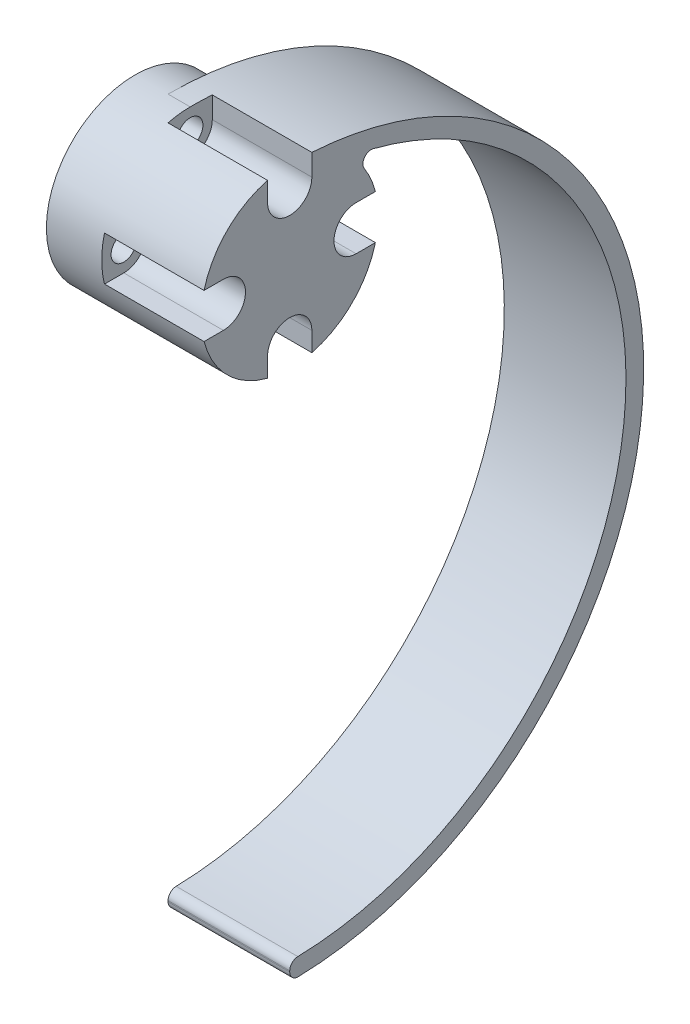
ISO-10303-21;
HEADER;
FILE_DESCRIPTION(('STEP AP214'),'2;1');
FILE_NAME('part.step','',(''),(''),'','','');
FILE_SCHEMA(('AUTOMOTIVE_DESIGN { 1 0 10303 214 1 1 1 1 }'));
ENDSEC;
DATA;
#1=APPLICATION_CONTEXT('core data for automotive mechanical design processes');
#2=APPLICATION_PROTOCOL_DEFINITION('international standard','automotive_design',2000,#1);
#3=PRODUCT_CONTEXT('',#1,'mechanical');
#4=PRODUCT('Part','Part','',(#3));
#5=PRODUCT_RELATED_PRODUCT_CATEGORY('part','',(#4));
#6=PRODUCT_DEFINITION_FORMATION('','',#4);
#7=PRODUCT_DEFINITION_CONTEXT('part definition',#1,'design');
#8=PRODUCT_DEFINITION('design','',#6,#7);
#9=PRODUCT_DEFINITION_SHAPE('','',#8);
#10=(LENGTH_UNIT() NAMED_UNIT(*) SI_UNIT(.MILLI.,.METRE.));
#11=(NAMED_UNIT(*) PLANE_ANGLE_UNIT() SI_UNIT($,.RADIAN.));
#12=(NAMED_UNIT(*) SI_UNIT($,.STERADIAN.) SOLID_ANGLE_UNIT());
#13=UNCERTAINTY_MEASURE_WITH_UNIT(LENGTH_MEASURE(1.E-05),#10,'distance_accuracy_value','');
#14=(GEOMETRIC_REPRESENTATION_CONTEXT(3) GLOBAL_UNCERTAINTY_ASSIGNED_CONTEXT((#13)) GLOBAL_UNIT_ASSIGNED_CONTEXT((#10,
#11,#12)) REPRESENTATION_CONTEXT('',''));
#15=CARTESIAN_POINT('',(0.,0.,0.));
#16=DIRECTION('',(0.,0.,1.));
#17=DIRECTION('',(1.,0.,0.));
#18=AXIS2_PLACEMENT_3D('',#15,#16,#17);
#19=CARTESIAN_POINT('',(11.,6.,0.));
#20=DIRECTION('',(-1.,0.,0.));
#21=DIRECTION('',(0.,0.,1.));
#22=AXIS2_PLACEMENT_3D('',#19,#20,#21);
#23=CYLINDRICAL_SURFACE('',#22,1.15);
#24=CARTESIAN_POINT('',(-3.,6.,0.));
#25=DIRECTION('',(1.,0.,0.));
#26=DIRECTION('',(0.,0.,-1.));
#27=AXIS2_PLACEMENT_3D('',#24,#25,#26);
#28=CIRCLE('',#27,1.15);
#29=CARTESIAN_POINT('',(-3.,6.,-1.15));
#30=VERTEX_POINT('',#29);
#31=EDGE_CURVE('E347',#30,#30,#28,.T.);
#32=ORIENTED_EDGE('',*,*,#31,.F.);
#33=EDGE_LOOP('',(#32));
#34=FACE_BOUND('',#33,.T.);
#35=CARTESIAN_POINT('',(2.,6.,0.));
#36=DIRECTION('',(1.,0.,0.));
#37=DIRECTION('',(0.,0.,-1.));
#38=AXIS2_PLACEMENT_3D('',#35,#36,#37);
#39=CIRCLE('',#38,1.15);
#40=CARTESIAN_POINT('',(2.,6.,-1.15));
#41=VERTEX_POINT('',#40);
#42=EDGE_CURVE('E287',#41,#41,#39,.T.);
#43=ORIENTED_EDGE('',*,*,#42,.T.);
#44=EDGE_LOOP('',(#43));
#45=FACE_BOUND('',#44,.T.);
#46=ADVANCED_FACE('F34',(#34,#45),#23,.F.);
#47=CARTESIAN_POINT('',(11.,0.,6.));
#48=DIRECTION('',(-1.,0.,0.));
#49=DIRECTION('',(0.,0.,1.));
#50=AXIS2_PLACEMENT_3D('',#47,#48,#49);
#51=CYLINDRICAL_SURFACE('',#50,1.15);
#52=CARTESIAN_POINT('',(-3.,0.,6.));
#53=DIRECTION('',(1.,0.,0.));
#54=DIRECTION('',(0.,0.,-1.));
#55=AXIS2_PLACEMENT_3D('',#52,#53,#54);
#56=CIRCLE('',#55,1.15);
#57=CARTESIAN_POINT('',(-3.,0.,4.85));
#58=VERTEX_POINT('',#57);
#59=EDGE_CURVE('E344',#58,#58,#56,.T.);
#60=ORIENTED_EDGE('',*,*,#59,.F.);
#61=EDGE_LOOP('',(#60));
#62=FACE_BOUND('',#61,.T.);
#63=CARTESIAN_POINT('',(2.,0.,6.));
#64=DIRECTION('',(1.,0.,0.));
#65=DIRECTION('',(0.,0.,-1.));
#66=AXIS2_PLACEMENT_3D('',#63,#64,#65);
#67=CIRCLE('',#66,1.15);
#68=CARTESIAN_POINT('',(2.,0.,4.85));
#69=VERTEX_POINT('',#68);
#70=EDGE_CURVE('E296',#69,#69,#67,.T.);
#71=ORIENTED_EDGE('',*,*,#70,.T.);
#72=EDGE_LOOP('',(#71));
#73=FACE_BOUND('',#72,.T.);
#74=ADVANCED_FACE('F461',(#62,#73),#51,.F.);
#75=CARTESIAN_POINT('',(11.,-6.,0.));
#76=DIRECTION('',(-1.,0.,0.));
#77=DIRECTION('',(0.,0.,1.));
#78=AXIS2_PLACEMENT_3D('',#75,#76,#77);
#79=CYLINDRICAL_SURFACE('',#78,1.15);
#80=CARTESIAN_POINT('',(-3.,-6.,0.));
#81=DIRECTION('',(1.,0.,0.));
#82=DIRECTION('',(0.,0.,-1.));
#83=AXIS2_PLACEMENT_3D('',#80,#81,#82);
#84=CIRCLE('',#83,1.15);
#85=CARTESIAN_POINT('',(-3.,-6.,-1.15));
#86=VERTEX_POINT('',#85);
#87=EDGE_CURVE('E341',#86,#86,#84,.T.);
#88=ORIENTED_EDGE('',*,*,#87,.F.);
#89=EDGE_LOOP('',(#88));
#90=FACE_BOUND('',#89,.T.);
#91=CARTESIAN_POINT('',(2.,-6.,0.));
#92=DIRECTION('',(1.,0.,0.));
#93=DIRECTION('',(0.,0.,-1.));
#94=AXIS2_PLACEMENT_3D('',#91,#92,#93);
#95=CIRCLE('',#94,1.15);
#96=CARTESIAN_POINT('',(2.,-6.,-1.15));
#97=VERTEX_POINT('',#96);
#98=EDGE_CURVE('E293',#97,#97,#95,.T.);
#99=ORIENTED_EDGE('',*,*,#98,.T.);
#100=EDGE_LOOP('',(#99));
#101=FACE_BOUND('',#100,.T.);
#102=ADVANCED_FACE('F467',(#90,#101),#79,.F.);
#103=CARTESIAN_POINT('',(11.,0.,-6.));
#104=DIRECTION('',(-1.,0.,0.));
#105=DIRECTION('',(0.,0.,1.));
#106=AXIS2_PLACEMENT_3D('',#103,#104,#105);
#107=CYLINDRICAL_SURFACE('',#106,1.15);
#108=CARTESIAN_POINT('',(-3.,0.,-6.));
#109=DIRECTION('',(1.,0.,0.));
#110=DIRECTION('',(0.,0.,-1.));
#111=AXIS2_PLACEMENT_3D('',#108,#109,#110);
#112=CIRCLE('',#111,1.15);
#113=CARTESIAN_POINT('',(-3.,0.,-7.15));
#114=VERTEX_POINT('',#113);
#115=EDGE_CURVE('E338',#114,#114,#112,.T.);
#116=ORIENTED_EDGE('',*,*,#115,.F.);
#117=EDGE_LOOP('',(#116));
#118=FACE_BOUND('',#117,.T.);
#119=CARTESIAN_POINT('',(2.,0.,-6.));
#120=DIRECTION('',(1.,0.,0.));
#121=DIRECTION('',(0.,0.,-1.));
#122=AXIS2_PLACEMENT_3D('',#119,#120,#121);
#123=CIRCLE('',#122,1.15);
#124=CARTESIAN_POINT('',(2.,0.,-7.15));
#125=VERTEX_POINT('',#124);
#126=EDGE_CURVE('E290',#125,#125,#123,.T.);
#127=ORIENTED_EDGE('',*,*,#126,.T.);
#128=EDGE_LOOP('',(#127));
#129=FACE_BOUND('',#128,.T.);
#130=ADVANCED_FACE('F479',(#118,#129),#107,.F.);
#131=CARTESIAN_POINT('',(11.,0.,0.));
#132=DIRECTION('',(-1.,0.,0.));
#133=DIRECTION('',(0.,0.,1.));
#134=AXIS2_PLACEMENT_3D('',#131,#132,#133);
#135=CYLINDRICAL_SURFACE('',#134,8.);
#136=CARTESIAN_POINT('',(0.,0.,0.));
#137=DIRECTION('',(1.,0.,0.));
#138=DIRECTION('',(0.,0.,-1.));
#139=AXIS2_PLACEMENT_3D('',#136,#137,#138);
#140=CIRCLE('',#139,8.00000000000009);
#141=CARTESIAN_POINT('',(0.,4.31542857142857,-6.73625090424177));
#142=VERTEX_POINT('',#141);
#143=CARTESIAN_POINT('',(0.,8.,0.));
#144=VERTEX_POINT('',#143);
#145=EDGE_CURVE('E324',#142,#144,#140,.T.);
#146=ORIENTED_EDGE('',*,*,#145,.F.);
#147=DIRECTION('',(-1.,0.,0.));
#148=VECTOR('',#147,1.);
#149=CARTESIAN_POINT('',(11.,4.31542857142857,-6.73625090424176));
#150=LINE('',#149,#148);
#151=CARTESIAN_POINT('',(11.,4.31542857142857,-6.73625090424176));
#152=VERTEX_POINT('',#151);
#153=EDGE_CURVE('E364',#142,#152,#150,.F.);
#154=ORIENTED_EDGE('',*,*,#153,.T.);
#155=CARTESIAN_POINT('',(11.,0.,0.));
#156=DIRECTION('',(1.,0.,0.));
#157=DIRECTION('',(0.,0.,-1.));
#158=AXIS2_PLACEMENT_3D('',#155,#156,#157);
#159=CIRCLE('',#158,8.);
#160=CARTESIAN_POINT('',(11.,2.,-7.74596669241483));
#161=VERTEX_POINT('',#160);
#162=EDGE_CURVE('E353',#161,#152,#159,.T.);
#163=ORIENTED_EDGE('',*,*,#162,.F.);
#164=DIRECTION('',(-1.,0.,0.));
#165=VECTOR('',#164,1.);
#166=CARTESIAN_POINT('',(11.,2.,-7.74596669241483));
#167=LINE('',#166,#165);
#168=CARTESIAN_POINT('',(2.,2.,-7.74596669241483));
#169=VERTEX_POINT('',#168);
#170=EDGE_CURVE('E314',#161,#169,#167,.T.);
#171=ORIENTED_EDGE('',*,*,#170,.T.);
#172=CARTESIAN_POINT('',(2.,0.,0.));
#173=DIRECTION('',(1.,0.,0.));
#174=DIRECTION('',(0.,0.,-1.));
#175=AXIS2_PLACEMENT_3D('',#172,#173,#174);
#176=CIRCLE('',#175,8.);
#177=CARTESIAN_POINT('',(2.,-2.,-7.74596669241483));
#178=VERTEX_POINT('',#177);
#179=EDGE_CURVE('E291',#178,#169,#176,.T.);
#180=ORIENTED_EDGE('',*,*,#179,.F.);
#181=DIRECTION('',(-1.,0.,0.));
#182=VECTOR('',#181,1.);
#183=CARTESIAN_POINT('',(11.,-2.,-7.74596669241483));
#184=LINE('',#183,#182);
#185=CARTESIAN_POINT('',(11.,-2.,-7.74596669241483));
#186=VERTEX_POINT('',#185);
#187=EDGE_CURVE('E311',#178,#186,#184,.F.);
#188=ORIENTED_EDGE('',*,*,#187,.T.);
#189=CARTESIAN_POINT('',(11.,-7.74596669241483,-2.));
#190=VERTEX_POINT('',#189);
#191=EDGE_CURVE('E356',#190,#186,#159,.T.);
#192=ORIENTED_EDGE('',*,*,#191,.F.);
#193=DIRECTION('',(-1.,0.,0.));
#194=VECTOR('',#193,1.);
#195=CARTESIAN_POINT('',(11.,-7.74596669241483,-2.));
#196=LINE('',#195,#194);
#197=CARTESIAN_POINT('',(2.,-7.74596669241483,-2.));
#198=VERTEX_POINT('',#197);
#199=EDGE_CURVE('E308',#190,#198,#196,.T.);
#200=ORIENTED_EDGE('',*,*,#199,.T.);
#201=CARTESIAN_POINT('',(2.,0.,0.));
#202=DIRECTION('',(1.,0.,0.));
#203=DIRECTION('',(0.,0.,-1.));
#204=AXIS2_PLACEMENT_3D('',#201,#202,#203);
#205=CIRCLE('',#204,8.);
#206=CARTESIAN_POINT('',(2.,-7.74596669241483,2.));
#207=VERTEX_POINT('',#206);
#208=EDGE_CURVE('E294',#207,#198,#205,.T.);
#209=ORIENTED_EDGE('',*,*,#208,.F.);
#210=DIRECTION('',(-1.,0.,0.));
#211=VECTOR('',#210,1.);
#212=CARTESIAN_POINT('',(11.,-7.74596669241483,2.));
#213=LINE('',#212,#211);
#214=CARTESIAN_POINT('',(11.,-7.74596669241483,2.));
#215=VERTEX_POINT('',#214);
#216=EDGE_CURVE('E305',#207,#215,#213,.F.);
#217=ORIENTED_EDGE('',*,*,#216,.T.);
#218=CARTESIAN_POINT('',(11.,-2.,7.74596669241483));
#219=VERTEX_POINT('',#218);
#220=EDGE_CURVE('E424',#219,#215,#159,.T.);
#221=ORIENTED_EDGE('',*,*,#220,.F.);
#222=DIRECTION('',(-1.,0.,0.));
#223=VECTOR('',#222,1.);
#224=CARTESIAN_POINT('',(11.,-2.,7.74596669241483));
#225=LINE('',#224,#223);
#226=CARTESIAN_POINT('',(2.,-2.,7.74596669241483));
#227=VERTEX_POINT('',#226);
#228=EDGE_CURVE('E302',#219,#227,#225,.T.);
#229=ORIENTED_EDGE('',*,*,#228,.T.);
#230=CARTESIAN_POINT('',(2.,0.,0.));
#231=DIRECTION('',(1.,0.,0.));
#232=DIRECTION('',(0.,0.,-1.));
#233=AXIS2_PLACEMENT_3D('',#230,#231,#232);
#234=CIRCLE('',#233,8.);
#235=CARTESIAN_POINT('',(2.,2.,7.74596669241483));
#236=VERTEX_POINT('',#235);
#237=EDGE_CURVE('E297',#236,#227,#234,.T.);
#238=ORIENTED_EDGE('',*,*,#237,.F.);
#239=DIRECTION('',(-1.,0.,0.));
#240=VECTOR('',#239,1.);
#241=CARTESIAN_POINT('',(11.,2.,7.74596669241483));
#242=LINE('',#241,#240);
#243=CARTESIAN_POINT('',(11.,2.,7.74596669241483));
#244=VERTEX_POINT('',#243);
#245=EDGE_CURVE('E299',#236,#244,#242,.F.);
#246=ORIENTED_EDGE('',*,*,#245,.T.);
#247=CARTESIAN_POINT('',(11.,7.74596669241483,2.));
#248=VERTEX_POINT('',#247);
#249=EDGE_CURVE('E357',#248,#244,#159,.T.);
#250=ORIENTED_EDGE('',*,*,#249,.F.);
#251=DIRECTION('',(-1.,0.,0.));
#252=VECTOR('',#251,1.);
#253=CARTESIAN_POINT('',(11.,7.74596669241483,2.));
#254=LINE('',#253,#252);
#255=CARTESIAN_POINT('',(2.,7.74596669241483,2.));
#256=VERTEX_POINT('',#255);
#257=EDGE_CURVE('E199',#248,#256,#254,.T.);
#258=ORIENTED_EDGE('',*,*,#257,.T.);
#259=CARTESIAN_POINT('',(2.,0.,0.));
#260=DIRECTION('',(1.,0.,0.));
#261=DIRECTION('',(0.,0.,-1.));
#262=AXIS2_PLACEMENT_3D('',#259,#260,#261);
#263=CIRCLE('',#262,8.);
#264=CARTESIAN_POINT('',(2.,8.,0.));
#265=VERTEX_POINT('',#264);
#266=EDGE_CURVE('E228',#265,#256,#263,.T.);
#267=ORIENTED_EDGE('',*,*,#266,.F.);
#268=DIRECTION('',(1.,0.,0.));
#269=VECTOR('',#268,1.);
#270=CARTESIAN_POINT('',(-71.5541752799933,8.,0.));
#271=LINE('',#270,#269);
#272=EDGE_CURVE('E322',#144,#265,#271,.T.);
#273=ORIENTED_EDGE('',*,*,#272,.F.);
#274=EDGE_LOOP('',(#146,#154,#163,#171,#180,#188,#192,#200,#209,#217,#221,#229,#238,#246,#250,
#258,#267,#273));
#275=FACE_BOUND('',#274,.T.);
#276=CARTESIAN_POINT('',(-3.,0.,0.));
#277=DIRECTION('',(1.,0.,0.));
#278=DIRECTION('',(0.,0.,-1.));
#279=AXIS2_PLACEMENT_3D('',#276,#277,#278);
#280=CIRCLE('',#279,8.);
#281=CARTESIAN_POINT('',(-3.,0.,-8.));
#282=VERTEX_POINT('',#281);
#283=EDGE_CURVE('E350',#282,#282,#280,.T.);
#284=ORIENTED_EDGE('',*,*,#283,.T.);
#285=EDGE_LOOP('',(#284));
#286=FACE_BOUND('',#285,.T.);
#287=ADVANCED_FACE('F420',(#275,#286),#135,.T.);
#288=CARTESIAN_POINT('',(11.,0.,0.));
#289=DIRECTION('',(1.,0.,0.));
#290=DIRECTION('',(0.,0.,-1.));
#291=AXIS2_PLACEMENT_3D('',#288,#289,#290);
#292=PLANE('',#291);
#293=CARTESIAN_POINT('',(11.,-24.,0.));
#294=DIRECTION('',(-1.,0.,0.));
#295=DIRECTION('',(0.,0.,1.));
#296=AXIS2_PLACEMENT_3D('',#293,#294,#295);
#297=CIRCLE('',#296,30.4);
#298=CARTESIAN_POINT('',(11.,5.44647554806071,-7.55414308823065));
#299=VERTEX_POINT('',#298);
#300=CARTESIAN_POINT('',(11.,-54.3911872192215,-0.731942215088282));
#301=VERTEX_POINT('',#300);
#302=EDGE_CURVE('E318',#299,#301,#297,.T.);
#303=ORIENTED_EDGE('',*,*,#302,.T.);
#304=CARTESIAN_POINT('',(11.,-55.1409697986431,-0.75));
#305=DIRECTION('',(1.,0.,0.));
#306=DIRECTION('',(0.,0.,-1.));
#307=AXIS2_PLACEMENT_3D('',#304,#305,#306);
#308=CIRCLE('',#307,0.75);
#309=CARTESIAN_POINT('',(11.,-55.1409697986431,0.));
#310=VERTEX_POINT('',#309);
#311=EDGE_CURVE('E380',#301,#310,#308,.T.);
#312=ORIENTED_EDGE('',*,*,#311,.T.);
#313=DIRECTION('',(0.,-1.,0.));
#314=VECTOR('',#313,1.);
#315=CARTESIAN_POINT('',(11.,-56.,0.));
#316=LINE('',#315,#314);
#317=CARTESIAN_POINT('',(11.,-55.2409987036266,0.));
#318=VERTEX_POINT('',#317);
#319=EDGE_CURVE('E329',#310,#318,#316,.T.);
#320=ORIENTED_EDGE('',*,*,#319,.T.);
#321=CARTESIAN_POINT('',(11.,-55.2409987036266,-0.75));
#322=DIRECTION('',(1.,0.,0.));
#323=DIRECTION('',(0.,0.,-1.));
#324=AXIS2_PLACEMENT_3D('',#321,#322,#323);
#325=CIRCLE('',#324,0.75);
#326=CARTESIAN_POINT('',(11.,-55.9907826725137,-0.768));
#327=VERTEX_POINT('',#326);
#328=EDGE_CURVE('E378',#318,#327,#325,.T.);
#329=ORIENTED_EDGE('',*,*,#328,.T.);
#330=CARTESIAN_POINT('',(11.,-24.,0.));
#331=DIRECTION('',(1.,0.,0.));
#332=DIRECTION('',(0.,0.,1.));
#333=AXIS2_PLACEMENT_3D('',#330,#331,#332);
#334=CIRCLE('',#333,32.);
#335=CARTESIAN_POINT('',(11.,7.93743884534263,-2.));
#336=VERTEX_POINT('',#335);
#337=EDGE_CURVE('E332',#327,#336,#334,.T.);
#338=ORIENTED_EDGE('',*,*,#337,.T.);
#339=DIRECTION('',(0.,1.,0.));
#340=VECTOR('',#339,1.);
#341=CARTESIAN_POINT('',(11.,8.,-2.));
#342=LINE('',#341,#340);
#343=CARTESIAN_POINT('',(11.,6.,-2.));
#344=VERTEX_POINT('',#343);
#345=EDGE_CURVE('E216',#344,#336,#342,.T.);
#346=ORIENTED_EDGE('',*,*,#345,.F.);
#347=CARTESIAN_POINT('',(11.,6.,0.));
#348=DIRECTION('',(1.,0.,0.));
#349=DIRECTION('',(0.,0.,1.));
#350=AXIS2_PLACEMENT_3D('',#347,#348,#349);
#351=CIRCLE('',#350,2.);
#352=CARTESIAN_POINT('',(11.,6.,2.));
#353=VERTEX_POINT('',#352);
#354=EDGE_CURVE('E204',#353,#344,#351,.T.);
#355=ORIENTED_EDGE('',*,*,#354,.F.);
#356=DIRECTION('',(0.,-1.,0.));
#357=VECTOR('',#356,1.);
#358=CARTESIAN_POINT('',(11.,6.,2.));
#359=LINE('',#358,#357);
#360=EDGE_CURVE('E193',#248,#353,#359,.T.);
#361=ORIENTED_EDGE('',*,*,#360,.F.);
#362=ORIENTED_EDGE('',*,*,#249,.T.);
#363=DIRECTION('',(0.,0.,1.));
#364=VECTOR('',#363,1.);
#365=CARTESIAN_POINT('',(11.,2.,8.));
#366=LINE('',#365,#364);
#367=CARTESIAN_POINT('',(11.,2.,6.));
#368=VERTEX_POINT('',#367);
#369=EDGE_CURVE('E280',#368,#244,#366,.T.);
#370=ORIENTED_EDGE('',*,*,#369,.F.);
#371=CARTESIAN_POINT('',(11.,0.,6.));
#372=DIRECTION('',(1.,0.,0.));
#373=DIRECTION('',(0.,0.,1.));
#374=AXIS2_PLACEMENT_3D('',#371,#372,#373);
#375=CIRCLE('',#374,2.);
#376=CARTESIAN_POINT('',(11.,-2.,6.));
#377=VERTEX_POINT('',#376);
#378=EDGE_CURVE('E277',#377,#368,#375,.T.);
#379=ORIENTED_EDGE('',*,*,#378,.F.);
#380=DIRECTION('',(0.,0.,-1.));
#381=VECTOR('',#380,1.);
#382=CARTESIAN_POINT('',(11.,-2.,6.));
#383=LINE('',#382,#381);
#384=EDGE_CURVE('E274',#219,#377,#383,.T.);
#385=ORIENTED_EDGE('',*,*,#384,.F.);
#386=ORIENTED_EDGE('',*,*,#220,.T.);
#387=DIRECTION('',(0.,-1.,0.));
#388=VECTOR('',#387,1.);
#389=CARTESIAN_POINT('',(11.,-8.,2.));
#390=LINE('',#389,#388);
#391=CARTESIAN_POINT('',(11.,-6.,2.));
#392=VERTEX_POINT('',#391);
#393=EDGE_CURVE('E262',#392,#215,#390,.T.);
#394=ORIENTED_EDGE('',*,*,#393,.F.);
#395=CARTESIAN_POINT('',(11.,-6.,0.));
#396=DIRECTION('',(1.,0.,0.));
#397=DIRECTION('',(0.,0.,1.));
#398=AXIS2_PLACEMENT_3D('',#395,#396,#397);
#399=CIRCLE('',#398,2.);
#400=CARTESIAN_POINT('',(11.,-6.,-2.));
#401=VERTEX_POINT('',#400);
#402=EDGE_CURVE('E258',#401,#392,#399,.T.);
#403=ORIENTED_EDGE('',*,*,#402,.F.);
#404=DIRECTION('',(0.,1.,0.));
#405=VECTOR('',#404,1.);
#406=CARTESIAN_POINT('',(11.,-6.,-2.));
#407=LINE('',#406,#405);
#408=EDGE_CURVE('E255',#190,#401,#407,.T.);
#409=ORIENTED_EDGE('',*,*,#408,.F.);
#410=ORIENTED_EDGE('',*,*,#191,.T.);
#411=DIRECTION('',(0.,0.,-1.));
#412=VECTOR('',#411,1.);
#413=CARTESIAN_POINT('',(11.,-2.,-8.));
#414=LINE('',#413,#412);
#415=CARTESIAN_POINT('',(11.,-2.,-6.));
#416=VERTEX_POINT('',#415);
#417=EDGE_CURVE('E243',#416,#186,#414,.T.);
#418=ORIENTED_EDGE('',*,*,#417,.F.);
#419=CARTESIAN_POINT('',(11.,0.,-6.));
#420=DIRECTION('',(1.,0.,0.));
#421=DIRECTION('',(0.,0.,1.));
#422=AXIS2_PLACEMENT_3D('',#419,#420,#421);
#423=CIRCLE('',#422,2.);
#424=CARTESIAN_POINT('',(11.,2.,-6.));
#425=VERTEX_POINT('',#424);
#426=EDGE_CURVE('E239',#425,#416,#423,.T.);
#427=ORIENTED_EDGE('',*,*,#426,.F.);
#428=DIRECTION('',(0.,0.,1.));
#429=VECTOR('',#428,1.);
#430=CARTESIAN_POINT('',(11.,2.,-6.));
#431=LINE('',#430,#429);
#432=EDGE_CURVE('E236',#161,#425,#431,.T.);
#433=ORIENTED_EDGE('',*,*,#432,.F.);
#434=ORIENTED_EDGE('',*,*,#162,.T.);
#435=CARTESIAN_POINT('',(11.,4.72,-7.36777442651443));
#436=DIRECTION('',(1.,0.,0.));
#437=DIRECTION('',(0.,0.,-1.));
#438=AXIS2_PLACEMENT_3D('',#435,#436,#437);
#439=CIRCLE('',#438,0.75);
#440=EDGE_CURVE('E42',#152,#299,#439,.F.);
#441=ORIENTED_EDGE('',*,*,#440,.T.);
#442=EDGE_LOOP('',(#303,#312,#320,#329,#338,#346,#355,#361,#362,#370,#379,#385,#386,#394,#403,
#409,#410,#418,#427,#433,#434,#441));
#443=FACE_BOUND('',#442,.T.);
#444=ADVANCED_FACE('F219',(#443),#292,.T.);
#445=CARTESIAN_POINT('',(-3.,0.,0.));
#446=DIRECTION('',(1.,0.,0.));
#447=DIRECTION('',(0.,0.,-1.));
#448=AXIS2_PLACEMENT_3D('',#445,#446,#447);
#449=PLANE('',#448);
#450=ORIENTED_EDGE('',*,*,#115,.T.);
#451=EDGE_LOOP('',(#450));
#452=FACE_BOUND('',#451,.T.);
#453=ORIENTED_EDGE('',*,*,#87,.T.);
#454=EDGE_LOOP('',(#453));
#455=FACE_BOUND('',#454,.T.);
#456=ORIENTED_EDGE('',*,*,#59,.T.);
#457=EDGE_LOOP('',(#456));
#458=FACE_BOUND('',#457,.T.);
#459=ORIENTED_EDGE('',*,*,#31,.T.);
#460=EDGE_LOOP('',(#459));
#461=FACE_BOUND('',#460,.T.);
#462=ORIENTED_EDGE('',*,*,#283,.F.);
#463=EDGE_LOOP('',(#462));
#464=FACE_BOUND('',#463,.T.);
#465=ADVANCED_FACE('F476',(#452,#455,#458,#461,#464),#449,.F.);
#466=CARTESIAN_POINT('',(-71.5541752799933,-24.,0.));
#467=DIRECTION('',(1.,0.,0.));
#468=DIRECTION('',(0.,0.,-1.));
#469=AXIS2_PLACEMENT_3D('',#466,#467,#468);
#470=CYLINDRICAL_SURFACE('',#469,32.);
#471=ORIENTED_EDGE('',*,*,#337,.F.);
#472=DIRECTION('',(1.,0.,0.));
#473=VECTOR('',#472,1.);
#474=CARTESIAN_POINT('',(-71.5541752799933,-55.9907826725137,-0.768));
#475=LINE('',#474,#473);
#476=CARTESIAN_POINT('',(0.,-55.9907826725137,-0.768));
#477=VERTEX_POINT('',#476);
#478=EDGE_CURVE('E49',#327,#477,#475,.F.);
#479=ORIENTED_EDGE('',*,*,#478,.T.);
#480=CARTESIAN_POINT('',(0.,-24.,0.));
#481=DIRECTION('',(1.,0.,0.));
#482=DIRECTION('',(0.,0.,-1.));
#483=AXIS2_PLACEMENT_3D('',#480,#481,#482);
#484=CIRCLE('',#483,32.);
#485=EDGE_CURVE('E321',#144,#477,#484,.F.);
#486=ORIENTED_EDGE('',*,*,#485,.F.);
#487=ORIENTED_EDGE('',*,*,#272,.T.);
#488=CARTESIAN_POINT('',(2.,-24.,0.));
#489=DIRECTION('',(1.,0.,0.));
#490=DIRECTION('',(0.,0.,-1.));
#491=AXIS2_PLACEMENT_3D('',#488,#489,#490);
#492=CIRCLE('',#491,32.);
#493=CARTESIAN_POINT('',(2.,7.93743884534263,-2.));
#494=VERTEX_POINT('',#493);
#495=EDGE_CURVE('E358',#265,#494,#492,.F.);
#496=ORIENTED_EDGE('',*,*,#495,.T.);
#497=DIRECTION('',(1.,0.,0.));
#498=VECTOR('',#497,1.);
#499=CARTESIAN_POINT('',(-71.5541752799933,7.93743884534263,-2.));
#500=LINE('',#499,#498);
#501=EDGE_CURVE('E361',#336,#494,#500,.F.);
#502=ORIENTED_EDGE('',*,*,#501,.F.);
#503=EDGE_LOOP('',(#471,#479,#486,#487,#496,#502));
#504=FACE_BOUND('',#503,.T.);
#505=ADVANCED_FACE('F412',(#504),#470,.T.);
#506=CARTESIAN_POINT('',(-71.5541752799933,-56.,0.));
#507=DIRECTION('',(0.,0.,1.));
#508=DIRECTION('',(1.,0.,0.));
#509=AXIS2_PLACEMENT_3D('',#506,#507,#508);
#510=PLANE('',#509);
#511=ORIENTED_EDGE('',*,*,#319,.F.);
#512=DIRECTION('',(1.,0.,0.));
#513=VECTOR('',#512,1.);
#514=CARTESIAN_POINT('',(-71.5541752799933,-55.1409697986431,0.));
#515=LINE('',#514,#513);
#516=CARTESIAN_POINT('',(0.,-55.1409697986431,0.));
#517=VERTEX_POINT('',#516);
#518=EDGE_CURVE('E57',#310,#517,#515,.F.);
#519=ORIENTED_EDGE('',*,*,#518,.T.);
#520=DIRECTION('',(0.,1.,0.));
#521=VECTOR('',#520,1.);
#522=CARTESIAN_POINT('',(0.,-56.,0.));
#523=LINE('',#522,#521);
#524=CARTESIAN_POINT('',(0.,-55.2409987036266,0.));
#525=VERTEX_POINT('',#524);
#526=EDGE_CURVE('E319',#525,#517,#523,.T.);
#527=ORIENTED_EDGE('',*,*,#526,.F.);
#528=DIRECTION('',(1.,0.,0.));
#529=VECTOR('',#528,1.);
#530=CARTESIAN_POINT('',(-71.5541752799933,-55.2409987036266,0.));
#531=LINE('',#530,#529);
#532=EDGE_CURVE('E382',#525,#318,#531,.T.);
#533=ORIENTED_EDGE('',*,*,#532,.T.);
#534=EDGE_LOOP('',(#511,#519,#527,#533));
#535=FACE_BOUND('',#534,.T.);
#536=ADVANCED_FACE('F407',(#535),#510,.T.);
#537=CARTESIAN_POINT('',(-71.5541752799933,-24.,0.));
#538=DIRECTION('',(1.,0.,0.));
#539=DIRECTION('',(0.,0.,-1.));
#540=AXIS2_PLACEMENT_3D('',#537,#538,#539);
#541=CYLINDRICAL_SURFACE('',#540,30.4);
#542=ORIENTED_EDGE('',*,*,#302,.F.);
#543=DIRECTION('',(1.,0.,0.));
#544=VECTOR('',#543,1.);
#545=CARTESIAN_POINT('',(-71.5541752799933,5.44647554806071,-7.55414308823065));
#546=LINE('',#545,#544);
#547=CARTESIAN_POINT('',(0.,5.44647554806071,-7.55414308823065));
#548=VERTEX_POINT('',#547);
#549=EDGE_CURVE('E376',#299,#548,#546,.F.);
#550=ORIENTED_EDGE('',*,*,#549,.T.);
#551=CARTESIAN_POINT('',(0.,-24.,0.));
#552=DIRECTION('',(1.,0.,0.));
#553=DIRECTION('',(0.,0.,-1.));
#554=AXIS2_PLACEMENT_3D('',#551,#552,#553);
#555=CIRCLE('',#554,30.4);
#556=CARTESIAN_POINT('',(0.,-54.3911872192215,-0.731942215088282));
#557=VERTEX_POINT('',#556);
#558=EDGE_CURVE('E327',#557,#548,#555,.T.);
#559=ORIENTED_EDGE('',*,*,#558,.F.);
#560=DIRECTION('',(1.,0.,0.));
#561=VECTOR('',#560,1.);
#562=CARTESIAN_POINT('',(-71.5541752799933,-54.3911872192215,-0.731942215088282));
#563=LINE('',#562,#561);
#564=EDGE_CURVE('E373',#557,#301,#563,.T.);
#565=ORIENTED_EDGE('',*,*,#564,.T.);
#566=EDGE_LOOP('',(#542,#550,#559,#565));
#567=FACE_BOUND('',#566,.T.);
#568=ADVANCED_FACE('F397',(#567),#541,.F.);
#569=CARTESIAN_POINT('',(0.,0.,0.));
#570=DIRECTION('',(1.,0.,0.));
#571=DIRECTION('',(0.,0.,-1.));
#572=AXIS2_PLACEMENT_3D('',#569,#570,#571);
#573=PLANE('',#572);
#574=ORIENTED_EDGE('',*,*,#526,.T.);
#575=CARTESIAN_POINT('',(0.,-55.1409697986431,-0.75));
#576=DIRECTION('',(1.,0.,0.));
#577=DIRECTION('',(0.,0.,-1.));
#578=AXIS2_PLACEMENT_3D('',#575,#576,#577);
#579=CIRCLE('',#578,0.75);
#580=EDGE_CURVE('E388',#517,#557,#579,.F.);
#581=ORIENTED_EDGE('',*,*,#580,.T.);
#582=ORIENTED_EDGE('',*,*,#558,.T.);
#583=CARTESIAN_POINT('',(0.,4.72,-7.36777442651443));
#584=DIRECTION('',(1.,0.,0.));
#585=DIRECTION('',(0.,0.,-1.));
#586=AXIS2_PLACEMENT_3D('',#583,#584,#585);
#587=CIRCLE('',#586,0.75);
#588=EDGE_CURVE('E12',#548,#142,#587,.T.);
#589=ORIENTED_EDGE('',*,*,#588,.T.);
#590=ORIENTED_EDGE('',*,*,#145,.T.);
#591=ORIENTED_EDGE('',*,*,#485,.T.);
#592=CARTESIAN_POINT('',(0.,-55.2409987036266,-0.75));
#593=DIRECTION('',(1.,0.,0.));
#594=DIRECTION('',(0.,0.,-1.));
#595=AXIS2_PLACEMENT_3D('',#592,#593,#594);
#596=CIRCLE('',#595,0.75);
#597=EDGE_CURVE('E386',#477,#525,#596,.F.);
#598=ORIENTED_EDGE('',*,*,#597,.T.);
#599=EDGE_LOOP('',(#574,#581,#582,#589,#590,#591,#598));
#600=FACE_BOUND('',#599,.T.);
#601=ADVANCED_FACE('F403',(#600),#573,.F.);
#602=CARTESIAN_POINT('',(-8.65685424949238,6.,2.));
#603=DIRECTION('',(0.,0.,1.));
#604=DIRECTION('',(1.,0.,0.));
#605=AXIS2_PLACEMENT_3D('',#602,#603,#604);
#606=PLANE('',#605);
#607=ORIENTED_EDGE('',*,*,#360,.T.);
#608=DIRECTION('',(1.,0.,0.));
#609=VECTOR('',#608,1.);
#610=CARTESIAN_POINT('',(-8.65685424949238,6.,2.));
#611=LINE('',#610,#609);
#612=CARTESIAN_POINT('',(2.,6.,2.));
#613=VERTEX_POINT('',#612);
#614=EDGE_CURVE('E197',#613,#353,#611,.T.);
#615=ORIENTED_EDGE('',*,*,#614,.F.);
#616=DIRECTION('',(0.,1.,0.));
#617=VECTOR('',#616,1.);
#618=CARTESIAN_POINT('',(2.,6.,2.));
#619=LINE('',#618,#617);
#620=EDGE_CURVE('E229',#613,#256,#619,.T.);
#621=ORIENTED_EDGE('',*,*,#620,.T.);
#622=ORIENTED_EDGE('',*,*,#257,.F.);
#623=EDGE_LOOP('',(#607,#615,#621,#622));
#624=FACE_BOUND('',#623,.T.);
#625=ADVANCED_FACE('F195',(#624),#606,.F.);
#626=CARTESIAN_POINT('',(2.,0.,0.));
#627=DIRECTION('',(1.,0.,0.));
#628=DIRECTION('',(0.,0.,-1.));
#629=AXIS2_PLACEMENT_3D('',#626,#627,#628);
#630=PLANE('',#629);
#631=ORIENTED_EDGE('',*,*,#42,.F.);
#632=EDGE_LOOP('',(#631));
#633=FACE_BOUND('',#632,.T.);
#634=ORIENTED_EDGE('',*,*,#266,.T.);
#635=ORIENTED_EDGE('',*,*,#620,.F.);
#636=CARTESIAN_POINT('',(2.,6.,0.));
#637=DIRECTION('',(1.,0.,0.));
#638=DIRECTION('',(0.,0.,-1.));
#639=AXIS2_PLACEMENT_3D('',#636,#637,#638);
#640=CIRCLE('',#639,2.);
#641=CARTESIAN_POINT('',(2.,6.,-2.));
#642=VERTEX_POINT('',#641);
#643=EDGE_CURVE('E213',#642,#613,#640,.F.);
#644=ORIENTED_EDGE('',*,*,#643,.F.);
#645=DIRECTION('',(0.,-1.,0.));
#646=VECTOR('',#645,1.);
#647=CARTESIAN_POINT('',(2.,8.,-2.));
#648=LINE('',#647,#646);
#649=EDGE_CURVE('E225',#494,#642,#648,.T.);
#650=ORIENTED_EDGE('',*,*,#649,.F.);
#651=ORIENTED_EDGE('',*,*,#495,.F.);
#652=EDGE_LOOP('',(#634,#635,#644,#650,#651));
#653=FACE_BOUND('',#652,.T.);
#654=ADVANCED_FACE('F416',(#633,#653),#630,.T.);
#655=CARTESIAN_POINT('',(-8.65685424949238,8.,-2.));
#656=DIRECTION('',(0.,0.,-1.));
#657=DIRECTION('',(0.,1.,0.));
#658=AXIS2_PLACEMENT_3D('',#655,#656,#657);
#659=PLANE('',#658);
#660=ORIENTED_EDGE('',*,*,#501,.T.);
#661=ORIENTED_EDGE('',*,*,#649,.T.);
#662=DIRECTION('',(1.,0.,0.));
#663=VECTOR('',#662,1.);
#664=CARTESIAN_POINT('',(-8.65685424949238,6.,-2.));
#665=LINE('',#664,#663);
#666=EDGE_CURVE('E215',#642,#344,#665,.T.);
#667=ORIENTED_EDGE('',*,*,#666,.T.);
#668=ORIENTED_EDGE('',*,*,#345,.T.);
#669=EDGE_LOOP('',(#660,#661,#667,#668));
#670=FACE_BOUND('',#669,.T.);
#671=ADVANCED_FACE('F414',(#670),#659,.F.);
#672=CARTESIAN_POINT('',(-8.65685424949238,6.,0.));
#673=DIRECTION('',(1.,0.,0.));
#674=DIRECTION('',(0.,0.,-1.));
#675=AXIS2_PLACEMENT_3D('',#672,#673,#674);
#676=CYLINDRICAL_SURFACE('',#675,2.);
#677=ORIENTED_EDGE('',*,*,#643,.T.);
#678=ORIENTED_EDGE('',*,*,#614,.T.);
#679=ORIENTED_EDGE('',*,*,#354,.T.);
#680=ORIENTED_EDGE('',*,*,#666,.F.);
#681=EDGE_LOOP('',(#677,#678,#679,#680));
#682=FACE_BOUND('',#681,.T.);
#683=ADVANCED_FACE('F209',(#682),#676,.F.);
#684=CARTESIAN_POINT('',(-8.65685424949238,2.,-6.));
#685=DIRECTION('',(0.,1.,0.));
#686=DIRECTION('',(0.,0.,1.));
#687=AXIS2_PLACEMENT_3D('',#684,#685,#686);
#688=PLANE('',#687);
#689=ORIENTED_EDGE('',*,*,#432,.T.);
#690=DIRECTION('',(1.,0.,0.));
#691=VECTOR('',#690,1.);
#692=CARTESIAN_POINT('',(-8.65685424949238,2.,-6.));
#693=LINE('',#692,#691);
#694=CARTESIAN_POINT('',(2.,2.,-6.));
#695=VERTEX_POINT('',#694);
#696=EDGE_CURVE('E245',#695,#425,#693,.T.);
#697=ORIENTED_EDGE('',*,*,#696,.F.);
#698=DIRECTION('',(0.,0.,-1.));
#699=VECTOR('',#698,1.);
#700=CARTESIAN_POINT('',(2.,2.,-6.));
#701=LINE('',#700,#699);
#702=EDGE_CURVE('E232',#695,#169,#701,.T.);
#703=ORIENTED_EDGE('',*,*,#702,.T.);
#704=ORIENTED_EDGE('',*,*,#170,.F.);
#705=EDGE_LOOP('',(#689,#697,#703,#704));
#706=FACE_BOUND('',#705,.T.);
#707=ADVANCED_FACE('F449',(#706),#688,.F.);
#708=CARTESIAN_POINT('',(-8.65685424949238,-2.,-8.));
#709=DIRECTION('',(0.,-1.,0.));
#710=DIRECTION('',(0.,0.,-1.));
#711=AXIS2_PLACEMENT_3D('',#708,#709,#710);
#712=PLANE('',#711);
#713=DIRECTION('',(0.,0.,1.));
#714=VECTOR('',#713,1.);
#715=CARTESIAN_POINT('',(2.,-2.,-8.));
#716=LINE('',#715,#714);
#717=CARTESIAN_POINT('',(2.,-2.,-6.));
#718=VERTEX_POINT('',#717);
#719=EDGE_CURVE('E230',#178,#718,#716,.T.);
#720=ORIENTED_EDGE('',*,*,#719,.T.);
#721=DIRECTION('',(1.,0.,0.));
#722=VECTOR('',#721,1.);
#723=CARTESIAN_POINT('',(-8.65685424949238,-2.,-6.));
#724=LINE('',#723,#722);
#725=EDGE_CURVE('E233',#718,#416,#724,.T.);
#726=ORIENTED_EDGE('',*,*,#725,.T.);
#727=ORIENTED_EDGE('',*,*,#417,.T.);
#728=ORIENTED_EDGE('',*,*,#187,.F.);
#729=EDGE_LOOP('',(#720,#726,#727,#728));
#730=FACE_BOUND('',#729,.T.);
#731=ADVANCED_FACE('F439',(#730),#712,.F.);
#732=CARTESIAN_POINT('',(2.,0.,0.));
#733=DIRECTION('',(1.,0.,0.));
#734=DIRECTION('',(0.,0.,-1.));
#735=AXIS2_PLACEMENT_3D('',#732,#733,#734);
#736=PLANE('',#735);
#737=ORIENTED_EDGE('',*,*,#126,.F.);
#738=EDGE_LOOP('',(#737));
#739=FACE_BOUND('',#738,.T.);
#740=ORIENTED_EDGE('',*,*,#179,.T.);
#741=ORIENTED_EDGE('',*,*,#702,.F.);
#742=CARTESIAN_POINT('',(2.,0.,-6.));
#743=DIRECTION('',(1.,0.,0.));
#744=DIRECTION('',(0.,0.,-1.));
#745=AXIS2_PLACEMENT_3D('',#742,#743,#744);
#746=CIRCLE('',#745,2.);
#747=EDGE_CURVE('E205',#718,#695,#746,.F.);
#748=ORIENTED_EDGE('',*,*,#747,.F.);
#749=ORIENTED_EDGE('',*,*,#719,.F.);
#750=EDGE_LOOP('',(#740,#741,#748,#749));
#751=FACE_BOUND('',#750,.T.);
#752=ADVANCED_FACE('F443',(#739,#751),#736,.T.);
#753=CARTESIAN_POINT('',(-8.65685424949238,0.,-6.));
#754=DIRECTION('',(1.,0.,0.));
#755=DIRECTION('',(0.,0.,-1.));
#756=AXIS2_PLACEMENT_3D('',#753,#754,#755);
#757=CYLINDRICAL_SURFACE('',#756,2.);
#758=ORIENTED_EDGE('',*,*,#747,.T.);
#759=ORIENTED_EDGE('',*,*,#696,.T.);
#760=ORIENTED_EDGE('',*,*,#426,.T.);
#761=ORIENTED_EDGE('',*,*,#725,.F.);
#762=EDGE_LOOP('',(#758,#759,#760,#761));
#763=FACE_BOUND('',#762,.T.);
#764=ADVANCED_FACE('F447',(#763),#757,.F.);
#765=CARTESIAN_POINT('',(-8.65685424949238,-6.,-2.));
#766=DIRECTION('',(0.,0.,-1.));
#767=DIRECTION('',(-1.,0.,0.));
#768=AXIS2_PLACEMENT_3D('',#765,#766,#767);
#769=PLANE('',#768);
#770=ORIENTED_EDGE('',*,*,#408,.T.);
#771=DIRECTION('',(1.,0.,0.));
#772=VECTOR('',#771,1.);
#773=CARTESIAN_POINT('',(-8.65685424949238,-6.,-2.));
#774=LINE('',#773,#772);
#775=CARTESIAN_POINT('',(2.,-6.,-2.));
#776=VERTEX_POINT('',#775);
#777=EDGE_CURVE('E264',#776,#401,#774,.T.);
#778=ORIENTED_EDGE('',*,*,#777,.F.);
#779=DIRECTION('',(0.,-1.,0.));
#780=VECTOR('',#779,1.);
#781=CARTESIAN_POINT('',(2.,-6.,-2.));
#782=LINE('',#781,#780);
#783=EDGE_CURVE('E251',#776,#198,#782,.T.);
#784=ORIENTED_EDGE('',*,*,#783,.T.);
#785=ORIENTED_EDGE('',*,*,#199,.F.);
#786=EDGE_LOOP('',(#770,#778,#784,#785));
#787=FACE_BOUND('',#786,.T.);
#788=ADVANCED_FACE('F616',(#787),#769,.F.);
#789=CARTESIAN_POINT('',(-8.65685424949238,-8.,2.));
#790=DIRECTION('',(0.,0.,1.));
#791=DIRECTION('',(0.,-1.,0.));
#792=AXIS2_PLACEMENT_3D('',#789,#790,#791);
#793=PLANE('',#792);
#794=DIRECTION('',(0.,1.,0.));
#795=VECTOR('',#794,1.);
#796=CARTESIAN_POINT('',(2.,-8.,2.));
#797=LINE('',#796,#795);
#798=CARTESIAN_POINT('',(2.,-6.,2.));
#799=VERTEX_POINT('',#798);
#800=EDGE_CURVE('E249',#207,#799,#797,.T.);
#801=ORIENTED_EDGE('',*,*,#800,.T.);
#802=DIRECTION('',(1.,0.,0.));
#803=VECTOR('',#802,1.);
#804=CARTESIAN_POINT('',(-8.65685424949238,-6.,2.));
#805=LINE('',#804,#803);
#806=EDGE_CURVE('E252',#799,#392,#805,.T.);
#807=ORIENTED_EDGE('',*,*,#806,.T.);
#808=ORIENTED_EDGE('',*,*,#393,.T.);
#809=ORIENTED_EDGE('',*,*,#216,.F.);
#810=EDGE_LOOP('',(#801,#807,#808,#809));
#811=FACE_BOUND('',#810,.T.);
#812=ADVANCED_FACE('F607',(#811),#793,.F.);
#813=CARTESIAN_POINT('',(2.,0.,0.));
#814=DIRECTION('',(1.,0.,0.));
#815=DIRECTION('',(0.,0.,-1.));
#816=AXIS2_PLACEMENT_3D('',#813,#814,#815);
#817=PLANE('',#816);
#818=ORIENTED_EDGE('',*,*,#98,.F.);
#819=EDGE_LOOP('',(#818));
#820=FACE_BOUND('',#819,.T.);
#821=ORIENTED_EDGE('',*,*,#208,.T.);
#822=ORIENTED_EDGE('',*,*,#783,.F.);
#823=CARTESIAN_POINT('',(2.,-6.,0.));
#824=DIRECTION('',(1.,0.,0.));
#825=DIRECTION('',(0.,0.,-1.));
#826=AXIS2_PLACEMENT_3D('',#823,#824,#825);
#827=CIRCLE('',#826,2.);
#828=EDGE_CURVE('E240',#799,#776,#827,.F.);
#829=ORIENTED_EDGE('',*,*,#828,.F.);
#830=ORIENTED_EDGE('',*,*,#800,.F.);
#831=EDGE_LOOP('',(#821,#822,#829,#830));
#832=FACE_BOUND('',#831,.T.);
#833=ADVANCED_FACE('F597',(#820,#832),#817,.T.);
#834=CARTESIAN_POINT('',(-8.65685424949238,-6.,0.));
#835=DIRECTION('',(1.,0.,0.));
#836=DIRECTION('',(0.,0.,-1.));
#837=AXIS2_PLACEMENT_3D('',#834,#835,#836);
#838=CYLINDRICAL_SURFACE('',#837,2.);
#839=ORIENTED_EDGE('',*,*,#828,.T.);
#840=ORIENTED_EDGE('',*,*,#777,.T.);
#841=ORIENTED_EDGE('',*,*,#402,.T.);
#842=ORIENTED_EDGE('',*,*,#806,.F.);
#843=EDGE_LOOP('',(#839,#840,#841,#842));
#844=FACE_BOUND('',#843,.T.);
#845=ADVANCED_FACE('F587',(#844),#838,.F.);
#846=CARTESIAN_POINT('',(-8.65685424949238,-2.,6.));
#847=DIRECTION('',(0.,-1.,0.));
#848=DIRECTION('',(0.,0.,-1.));
#849=AXIS2_PLACEMENT_3D('',#846,#847,#848);
#850=PLANE('',#849);
#851=ORIENTED_EDGE('',*,*,#384,.T.);
#852=DIRECTION('',(1.,0.,0.));
#853=VECTOR('',#852,1.);
#854=CARTESIAN_POINT('',(-8.65685424949238,-2.,6.));
#855=LINE('',#854,#853);
#856=CARTESIAN_POINT('',(2.,-2.,6.));
#857=VERTEX_POINT('',#856);
#858=EDGE_CURVE('E282',#857,#377,#855,.T.);
#859=ORIENTED_EDGE('',*,*,#858,.F.);
#860=DIRECTION('',(0.,0.,1.));
#861=VECTOR('',#860,1.);
#862=CARTESIAN_POINT('',(2.,-2.,6.));
#863=LINE('',#862,#861);
#864=EDGE_CURVE('E270',#857,#227,#863,.T.);
#865=ORIENTED_EDGE('',*,*,#864,.T.);
#866=ORIENTED_EDGE('',*,*,#228,.F.);
#867=EDGE_LOOP('',(#851,#859,#865,#866));
#868=FACE_BOUND('',#867,.T.);
#869=ADVANCED_FACE('F577',(#868),#850,.F.);
#870=CARTESIAN_POINT('',(-8.65685424949238,2.,8.));
#871=DIRECTION('',(0.,1.,0.));
#872=DIRECTION('',(0.,0.,1.));
#873=AXIS2_PLACEMENT_3D('',#870,#871,#872);
#874=PLANE('',#873);
#875=DIRECTION('',(0.,0.,-1.));
#876=VECTOR('',#875,1.);
#877=CARTESIAN_POINT('',(2.,2.,8.));
#878=LINE('',#877,#876);
#879=CARTESIAN_POINT('',(2.,2.,6.));
#880=VERTEX_POINT('',#879);
#881=EDGE_CURVE('E268',#236,#880,#878,.T.);
#882=ORIENTED_EDGE('',*,*,#881,.T.);
#883=DIRECTION('',(1.,0.,0.));
#884=VECTOR('',#883,1.);
#885=CARTESIAN_POINT('',(-8.65685424949238,2.,6.));
#886=LINE('',#885,#884);
#887=EDGE_CURVE('E271',#880,#368,#886,.T.);
#888=ORIENTED_EDGE('',*,*,#887,.T.);
#889=ORIENTED_EDGE('',*,*,#369,.T.);
#890=ORIENTED_EDGE('',*,*,#245,.F.);
#891=EDGE_LOOP('',(#882,#888,#889,#890));
#892=FACE_BOUND('',#891,.T.);
#893=ADVANCED_FACE('F567',(#892),#874,.F.);
#894=CARTESIAN_POINT('',(2.,0.,0.));
#895=DIRECTION('',(1.,0.,0.));
#896=DIRECTION('',(0.,0.,-1.));
#897=AXIS2_PLACEMENT_3D('',#894,#895,#896);
#898=PLANE('',#897);
#899=ORIENTED_EDGE('',*,*,#70,.F.);
#900=EDGE_LOOP('',(#899));
#901=FACE_BOUND('',#900,.T.);
#902=ORIENTED_EDGE('',*,*,#237,.T.);
#903=ORIENTED_EDGE('',*,*,#864,.F.);
#904=CARTESIAN_POINT('',(2.,0.,6.));
#905=DIRECTION('',(1.,0.,0.));
#906=DIRECTION('',(0.,0.,-1.));
#907=AXIS2_PLACEMENT_3D('',#904,#905,#906);
#908=CIRCLE('',#907,2.);
#909=EDGE_CURVE('E259',#880,#857,#908,.F.);
#910=ORIENTED_EDGE('',*,*,#909,.F.);
#911=ORIENTED_EDGE('',*,*,#881,.F.);
#912=EDGE_LOOP('',(#902,#903,#910,#911));
#913=FACE_BOUND('',#912,.T.);
#914=ADVANCED_FACE('F557',(#901,#913),#898,.T.);
#915=CARTESIAN_POINT('',(-8.65685424949238,0.,6.));
#916=DIRECTION('',(1.,0.,0.));
#917=DIRECTION('',(0.,0.,-1.));
#918=AXIS2_PLACEMENT_3D('',#915,#916,#917);
#919=CYLINDRICAL_SURFACE('',#918,2.);
#920=ORIENTED_EDGE('',*,*,#909,.T.);
#921=ORIENTED_EDGE('',*,*,#858,.T.);
#922=ORIENTED_EDGE('',*,*,#378,.T.);
#923=ORIENTED_EDGE('',*,*,#887,.F.);
#924=EDGE_LOOP('',(#920,#921,#922,#923));
#925=FACE_BOUND('',#924,.T.);
#926=ADVANCED_FACE('F481',(#925),#919,.F.);
#927=CARTESIAN_POINT('',(-71.5541752799933,4.72,-7.36777442651443));
#928=DIRECTION('',(1.,0.,0.));
#929=DIRECTION('',(0.,0.,-1.));
#930=AXIS2_PLACEMENT_3D('',#927,#928,#929);
#931=CYLINDRICAL_SURFACE('',#930,0.75);
#932=ORIENTED_EDGE('',*,*,#588,.F.);
#933=ORIENTED_EDGE('',*,*,#549,.F.);
#934=ORIENTED_EDGE('',*,*,#440,.F.);
#935=ORIENTED_EDGE('',*,*,#153,.F.);
#936=EDGE_LOOP('',(#932,#933,#934,#935));
#937=FACE_BOUND('',#936,.T.);
#938=ADVANCED_FACE('F401',(#937),#931,.F.);
#939=CARTESIAN_POINT('',(-71.5541752799933,-55.1409697986431,-0.75));
#940=DIRECTION('',(1.,0.,0.));
#941=DIRECTION('',(0.,0.,-1.));
#942=AXIS2_PLACEMENT_3D('',#939,#940,#941);
#943=CYLINDRICAL_SURFACE('',#942,0.75);
#944=ORIENTED_EDGE('',*,*,#580,.F.);
#945=ORIENTED_EDGE('',*,*,#518,.F.);
#946=ORIENTED_EDGE('',*,*,#311,.F.);
#947=ORIENTED_EDGE('',*,*,#564,.F.);
#948=EDGE_LOOP('',(#944,#945,#946,#947));
#949=FACE_BOUND('',#948,.T.);
#950=ADVANCED_FACE('F406',(#949),#943,.T.);
#951=CARTESIAN_POINT('',(-71.5541752799933,-55.2409987036266,-0.75));
#952=DIRECTION('',(1.,0.,0.));
#953=DIRECTION('',(0.,0.,-1.));
#954=AXIS2_PLACEMENT_3D('',#951,#952,#953);
#955=CYLINDRICAL_SURFACE('',#954,0.75);
#956=ORIENTED_EDGE('',*,*,#597,.F.);
#957=ORIENTED_EDGE('',*,*,#478,.F.);
#958=ORIENTED_EDGE('',*,*,#328,.F.);
#959=ORIENTED_EDGE('',*,*,#532,.F.);
#960=EDGE_LOOP('',(#956,#957,#958,#959));
#961=FACE_BOUND('',#960,.T.);
#962=ADVANCED_FACE('F36',(#961),#955,.T.);
#963=CLOSED_SHELL('',(#46,#74,#102,#130,#287,#444,#465,#505,#536,#568,#601,#625,#654,#671,#683,
#707,#731,#752,#764,#788,#812,#833,#845,#869,#893,#914,#926,#938,#950,#962));
#964=MANIFOLD_SOLID_BREP('B2',#963);
#965=ADVANCED_BREP_SHAPE_REPRESENTATION('',(#18,#964),#14);
#966=SHAPE_DEFINITION_REPRESENTATION(#9,#965);
ENDSEC;
END-ISO-10303-21;
